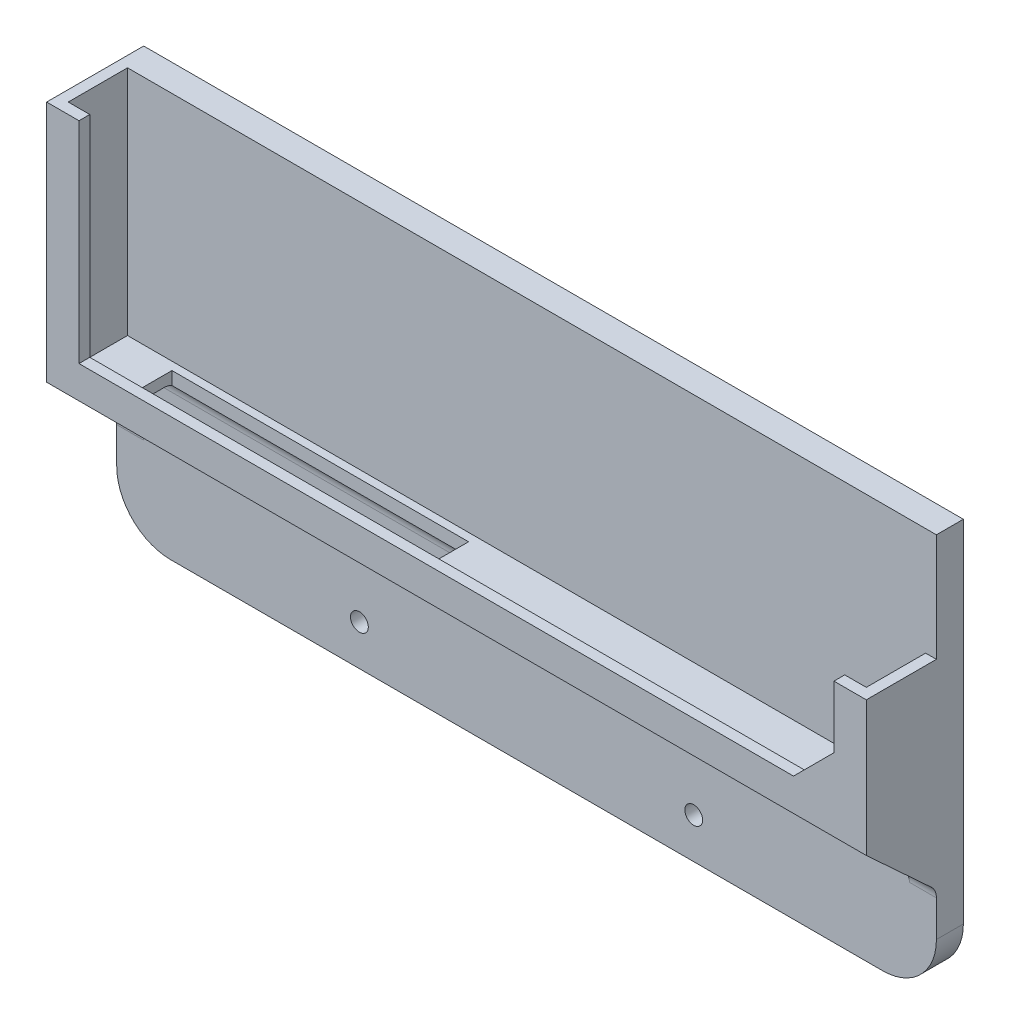
ISO-10303-21;
HEADER;
FILE_DESCRIPTION(('STEP AP214'),'2;1');
FILE_NAME('part.step','',(''),(''),'','','');
FILE_SCHEMA(('AUTOMOTIVE_DESIGN { 1 0 10303 214 1 1 1 1 }'));
ENDSEC;
DATA;
#1=APPLICATION_CONTEXT('core data for automotive mechanical design processes');
#2=APPLICATION_PROTOCOL_DEFINITION('international standard','automotive_design',2000,#1);
#3=PRODUCT_CONTEXT('',#1,'mechanical');
#4=PRODUCT('Part','Part','',(#3));
#5=PRODUCT_RELATED_PRODUCT_CATEGORY('part','',(#4));
#6=PRODUCT_DEFINITION_FORMATION('','',#4);
#7=PRODUCT_DEFINITION_CONTEXT('part definition',#1,'design');
#8=PRODUCT_DEFINITION('design','',#6,#7);
#9=PRODUCT_DEFINITION_SHAPE('','',#8);
#10=(LENGTH_UNIT() NAMED_UNIT(*) SI_UNIT(.MILLI.,.METRE.));
#11=(NAMED_UNIT(*) PLANE_ANGLE_UNIT() SI_UNIT($,.RADIAN.));
#12=(NAMED_UNIT(*) SI_UNIT($,.STERADIAN.) SOLID_ANGLE_UNIT());
#13=UNCERTAINTY_MEASURE_WITH_UNIT(LENGTH_MEASURE(1.E-05),#10,'distance_accuracy_value','');
#14=(GEOMETRIC_REPRESENTATION_CONTEXT(3) GLOBAL_UNCERTAINTY_ASSIGNED_CONTEXT((#13)) GLOBAL_UNIT_ASSIGNED_CONTEXT((#10,
#11,#12)) REPRESENTATION_CONTEXT('',''));
#15=CARTESIAN_POINT('',(0.,0.,0.));
#16=DIRECTION('',(0.,0.,1.));
#17=DIRECTION('',(1.,0.,0.));
#18=AXIS2_PLACEMENT_3D('',#15,#16,#17);
#19=CARTESIAN_POINT('',(0.,30.,16.));
#20=DIRECTION('',(0.,1.,0.));
#21=DIRECTION('',(0.,0.,1.));
#22=AXIS2_PLACEMENT_3D('',#19,#20,#21);
#23=PLANE('',#22);
#24=DIRECTION('',(0.,0.,-1.));
#25=VECTOR('',#24,1.);
#26=CARTESIAN_POINT('',(11.7410881152894,30.,16.));
#27=LINE('',#26,#25);
#28=CARTESIAN_POINT('',(11.7410881152894,30.,14.5));
#29=VERTEX_POINT('',#28);
#30=CARTESIAN_POINT('',(11.7410881152894,30.,8.));
#31=VERTEX_POINT('',#30);
#32=EDGE_CURVE('E269',#29,#31,#27,.T.);
#33=ORIENTED_EDGE('',*,*,#32,.F.);
#34=DIRECTION('',(1.,0.,0.));
#35=VECTOR('',#34,1.);
#36=CARTESIAN_POINT('',(0.,30.,14.5));
#37=LINE('',#36,#35);
#38=CARTESIAN_POINT('',(66.7410881152894,30.,14.5));
#39=VERTEX_POINT('',#38);
#40=EDGE_CURVE('E272',#29,#39,#37,.T.);
#41=ORIENTED_EDGE('',*,*,#40,.T.);
#42=DIRECTION('',(0.,0.,-1.));
#43=VECTOR('',#42,1.);
#44=CARTESIAN_POINT('',(66.7410881152894,30.,16.));
#45=LINE('',#44,#43);
#46=CARTESIAN_POINT('',(66.7410881152894,30.,8.));
#47=VERTEX_POINT('',#46);
#48=EDGE_CURVE('E261',#39,#47,#45,.T.);
#49=ORIENTED_EDGE('',*,*,#48,.T.);
#50=DIRECTION('',(1.,0.,0.));
#51=VECTOR('',#50,1.);
#52=CARTESIAN_POINT('',(0.,30.,8.));
#53=LINE('',#52,#51);
#54=CARTESIAN_POINT('',(147.,30.,8.));
#55=VERTEX_POINT('',#54);
#56=EDGE_CURVE('E512',#47,#55,#53,.T.);
#57=ORIENTED_EDGE('',*,*,#56,.T.);
#58=DIRECTION('',(0.,0.,-1.));
#59=VECTOR('',#58,1.);
#60=CARTESIAN_POINT('',(147.,30.,18.));
#61=LINE('',#60,#59);
#62=CARTESIAN_POINT('',(147.,30.,18.));
#63=VERTEX_POINT('',#62);
#64=EDGE_CURVE('E277',#63,#55,#61,.T.);
#65=ORIENTED_EDGE('',*,*,#64,.F.);
#66=DIRECTION('',(1.,0.,0.));
#67=VECTOR('',#66,1.);
#68=CARTESIAN_POINT('',(0.,30.,18.));
#69=LINE('',#68,#67);
#70=CARTESIAN_POINT('',(5.,30.,18.));
#71=VERTEX_POINT('',#70);
#72=EDGE_CURVE('E320',#71,#63,#69,.T.);
#73=ORIENTED_EDGE('',*,*,#72,.F.);
#74=DIRECTION('',(0.,0.,-1.));
#75=VECTOR('',#74,1.);
#76=CARTESIAN_POINT('',(5.,30.,18.));
#77=LINE('',#76,#75);
#78=CARTESIAN_POINT('',(5.,30.,8.));
#79=VERTEX_POINT('',#78);
#80=EDGE_CURVE('E296',#71,#79,#77,.T.);
#81=ORIENTED_EDGE('',*,*,#80,.T.);
#82=EDGE_CURVE('E513',#79,#31,#53,.T.);
#83=ORIENTED_EDGE('',*,*,#82,.T.);
#84=EDGE_LOOP('',(#33,#41,#49,#57,#65,#73,#81,#83));
#85=FACE_BOUND('',#84,.T.);
#86=ADVANCED_FACE('F40',(#85),#23,.F.);
#87=CARTESIAN_POINT('',(0.,27.,8.));
#88=DIRECTION('',(1.,0.,0.));
#89=DIRECTION('',(0.,0.,-1.));
#90=AXIS2_PLACEMENT_3D('',#87,#88,#89);
#91=CYLINDRICAL_SURFACE('',#90,3.);
#92=CARTESIAN_POINT('',(11.7410881152894,27.,8.));
#93=DIRECTION('',(1.,0.,0.));
#94=DIRECTION('',(0.,0.,-1.));
#95=AXIS2_PLACEMENT_3D('',#92,#93,#94);
#96=CIRCLE('',#95,3.);
#97=CARTESIAN_POINT('',(11.7410881152894,29.5980762113533,6.5));
#98=VERTEX_POINT('',#97);
#99=EDGE_CURVE('E11',#31,#98,#96,.F.);
#100=ORIENTED_EDGE('',*,*,#99,.F.);
#101=ORIENTED_EDGE('',*,*,#82,.F.);
#102=CARTESIAN_POINT('',(5.,27.,8.));
#103=DIRECTION('',(-1.,0.,0.));
#104=DIRECTION('',(0.,0.,1.));
#105=AXIS2_PLACEMENT_3D('',#102,#103,#104);
#106=CIRCLE('',#105,3.);
#107=CARTESIAN_POINT('',(5.,27.,5.));
#108=VERTEX_POINT('',#107);
#109=EDGE_CURVE('E531',#108,#79,#106,.F.);
#110=ORIENTED_EDGE('',*,*,#109,.F.);
#111=DIRECTION('',(1.,0.,0.));
#112=VECTOR('',#111,1.);
#113=CARTESIAN_POINT('',(0.,27.,5.));
#114=LINE('',#113,#112);
#115=CARTESIAN_POINT('',(147.,27.,5.));
#116=VERTEX_POINT('',#115);
#117=EDGE_CURVE('E528',#116,#108,#114,.F.);
#118=ORIENTED_EDGE('',*,*,#117,.F.);
#119=CARTESIAN_POINT('',(147.,27.,8.));
#120=DIRECTION('',(1.,0.,0.));
#121=DIRECTION('',(0.,0.,-1.));
#122=AXIS2_PLACEMENT_3D('',#119,#120,#121);
#123=CIRCLE('',#122,3.);
#124=EDGE_CURVE('E517',#55,#116,#123,.F.);
#125=ORIENTED_EDGE('',*,*,#124,.F.);
#126=ORIENTED_EDGE('',*,*,#56,.F.);
#127=CARTESIAN_POINT('',(66.7410881152894,27.,8.));
#128=DIRECTION('',(1.,0.,0.));
#129=DIRECTION('',(0.,0.,-1.));
#130=AXIS2_PLACEMENT_3D('',#127,#128,#129);
#131=CIRCLE('',#130,3.);
#132=CARTESIAN_POINT('',(66.7410881152894,29.5980762113533,6.5));
#133=VERTEX_POINT('',#132);
#134=EDGE_CURVE('E554',#47,#133,#131,.F.);
#135=ORIENTED_EDGE('',*,*,#134,.T.);
#136=DIRECTION('',(1.,0.,0.));
#137=VECTOR('',#136,1.);
#138=CARTESIAN_POINT('',(0.,29.5980762113533,6.5));
#139=LINE('',#138,#137);
#140=EDGE_CURVE('E49',#98,#133,#139,.T.);
#141=ORIENTED_EDGE('',*,*,#140,.F.);
#142=EDGE_LOOP('',(#100,#101,#110,#118,#125,#126,#135,#141));
#143=FACE_BOUND('',#142,.T.);
#144=ADVANCED_FACE('F652',(#143),#91,.F.);
#145=CARTESIAN_POINT('',(0.,0.,5.));
#146=DIRECTION('',(0.,0.,1.));
#147=DIRECTION('',(1.,0.,0.));
#148=AXIS2_PLACEMENT_3D('',#145,#146,#147);
#149=PLANE('',#148);
#150=DIRECTION('',(0.,-1.,0.));
#151=VECTOR('',#150,1.);
#152=CARTESIAN_POINT('',(147.,30.,5.));
#153=LINE('',#152,#151);
#154=CARTESIAN_POINT('',(147.,16.6865063047027,5.));
#155=VERTEX_POINT('',#154);
#156=EDGE_CURVE('E285',#116,#155,#153,.T.);
#157=ORIENTED_EDGE('',*,*,#156,.F.);
#158=ORIENTED_EDGE('',*,*,#117,.T.);
#159=DIRECTION('',(0.,-1.,0.));
#160=VECTOR('',#159,1.);
#161=CARTESIAN_POINT('',(5.,30.,5.));
#162=LINE('',#161,#160);
#163=CARTESIAN_POINT('',(5.,16.6865063047027,5.));
#164=VERTEX_POINT('',#163);
#165=EDGE_CURVE('E300',#108,#164,#162,.T.);
#166=ORIENTED_EDGE('',*,*,#165,.T.);
#167=DIRECTION('',(-1.,0.,0.));
#168=VECTOR('',#167,1.);
#169=CARTESIAN_POINT('',(0.,16.6865063047027,5.));
#170=LINE('',#169,#168);
#171=CARTESIAN_POINT('',(0.,16.6865063047027,5.));
#172=VERTEX_POINT('',#171);
#173=EDGE_CURVE('E520',#164,#172,#170,.T.);
#174=ORIENTED_EDGE('',*,*,#173,.T.);
#175=DIRECTION('',(0.,1.,0.));
#176=VECTOR('',#175,1.);
#177=CARTESIAN_POINT('',(0.,0.,5.));
#178=LINE('',#177,#176);
#179=CARTESIAN_POINT('',(0.,10.,5.));
#180=VERTEX_POINT('',#179);
#181=EDGE_CURVE('E420',#180,#172,#178,.T.);
#182=ORIENTED_EDGE('',*,*,#181,.F.);
#183=CARTESIAN_POINT('',(10.,10.,5.));
#184=DIRECTION('',(0.,0.,1.));
#185=DIRECTION('',(1.,0.,0.));
#186=AXIS2_PLACEMENT_3D('',#183,#184,#185);
#187=CIRCLE('',#186,10.);
#188=CARTESIAN_POINT('',(10.,0.,5.));
#189=VERTEX_POINT('',#188);
#190=EDGE_CURVE('E490',#180,#189,#187,.T.);
#191=ORIENTED_EDGE('',*,*,#190,.T.);
#192=DIRECTION('',(1.,0.,0.));
#193=VECTOR('',#192,1.);
#194=CARTESIAN_POINT('',(0.,0.,5.));
#195=LINE('',#194,#193);
#196=CARTESIAN_POINT('',(142.,0.,5.));
#197=VERTEX_POINT('',#196);
#198=EDGE_CURVE('E424',#189,#197,#195,.T.);
#199=ORIENTED_EDGE('',*,*,#198,.T.);
#200=CARTESIAN_POINT('',(142.,10.,5.));
#201=DIRECTION('',(0.,0.,1.));
#202=DIRECTION('',(1.,0.,0.));
#203=AXIS2_PLACEMENT_3D('',#200,#201,#202);
#204=CIRCLE('',#203,10.);
#205=CARTESIAN_POINT('',(152.,10.,5.));
#206=VERTEX_POINT('',#205);
#207=EDGE_CURVE('E493',#197,#206,#204,.T.);
#208=ORIENTED_EDGE('',*,*,#207,.T.);
#209=DIRECTION('',(0.,1.,0.));
#210=VECTOR('',#209,1.);
#211=CARTESIAN_POINT('',(152.,0.,5.));
#212=LINE('',#211,#210);
#213=CARTESIAN_POINT('',(152.,16.6865063047027,5.));
#214=VERTEX_POINT('',#213);
#215=EDGE_CURVE('E430',#206,#214,#212,.T.);
#216=ORIENTED_EDGE('',*,*,#215,.T.);
#217=DIRECTION('',(1.,0.,0.));
#218=VECTOR('',#217,1.);
#219=CARTESIAN_POINT('',(147.,16.6865063047027,5.));
#220=LINE('',#219,#218);
#221=EDGE_CURVE('E524',#214,#155,#220,.F.);
#222=ORIENTED_EDGE('',*,*,#221,.T.);
#223=EDGE_LOOP('',(#157,#158,#166,#174,#182,#191,#199,#208,#216,#222));
#224=FACE_BOUND('',#223,.T.);
#225=CARTESIAN_POINT('',(107.,7.5,5.));
#226=DIRECTION('',(0.,0.,1.));
#227=DIRECTION('',(1.,0.,0.));
#228=AXIS2_PLACEMENT_3D('',#225,#226,#227);
#229=CIRCLE('',#228,1.64999999999999);
#230=CARTESIAN_POINT('',(108.65,7.5,5.));
#231=VERTEX_POINT('',#230);
#232=EDGE_CURVE('E437',#231,#231,#229,.T.);
#233=ORIENTED_EDGE('',*,*,#232,.F.);
#234=EDGE_LOOP('',(#233));
#235=FACE_BOUND('',#234,.T.);
#236=CARTESIAN_POINT('',(45.,7.5,5.));
#237=DIRECTION('',(0.,0.,1.));
#238=DIRECTION('',(1.,0.,0.));
#239=AXIS2_PLACEMENT_3D('',#236,#237,#238);
#240=CIRCLE('',#239,1.65);
#241=CARTESIAN_POINT('',(46.65,7.5,5.));
#242=VERTEX_POINT('',#241);
#243=EDGE_CURVE('E441',#242,#242,#240,.T.);
#244=ORIENTED_EDGE('',*,*,#243,.F.);
#245=EDGE_LOOP('',(#244));
#246=FACE_BOUND('',#245,.T.);
#247=ADVANCED_FACE('F588',(#224,#235,#246),#149,.T.);
#248=DIRECTION('',(0.,1.,0.));
#249=VECTOR('',#248,1.);
#250=CARTESIAN_POINT('',(2.,73.,5.));
#251=LINE('',#250,#249);
#252=CARTESIAN_POINT('',(2.00000000000001,32.,5.));
#253=VERTEX_POINT('',#252);
#254=CARTESIAN_POINT('',(2.,75.,5.));
#255=VERTEX_POINT('',#254);
#256=EDGE_CURVE('E377',#253,#255,#251,.T.);
#257=ORIENTED_EDGE('',*,*,#256,.F.);
#258=DIRECTION('',(-1.,0.,0.));
#259=VECTOR('',#258,1.);
#260=CARTESIAN_POINT('',(2.00000000000001,32.,5.));
#261=LINE('',#260,#259);
#262=CARTESIAN_POINT('',(150.,32.,5.));
#263=VERTEX_POINT('',#262);
#264=EDGE_CURVE('E393',#263,#253,#261,.T.);
#265=ORIENTED_EDGE('',*,*,#264,.F.);
#266=DIRECTION('',(0.,-1.,0.));
#267=VECTOR('',#266,1.);
#268=CARTESIAN_POINT('',(150.,55.,5.));
#269=LINE('',#268,#267);
#270=CARTESIAN_POINT('',(150.,55.,5.));
#271=VERTEX_POINT('',#270);
#272=EDGE_CURVE('E389',#271,#263,#269,.T.);
#273=ORIENTED_EDGE('',*,*,#272,.F.);
#274=DIRECTION('',(-1.,0.,0.));
#275=VECTOR('',#274,1.);
#276=CARTESIAN_POINT('',(152.,55.,5.));
#277=LINE('',#276,#275);
#278=CARTESIAN_POINT('',(152.,55.,5.));
#279=VERTEX_POINT('',#278);
#280=EDGE_CURVE('E371',#279,#271,#277,.T.);
#281=ORIENTED_EDGE('',*,*,#280,.F.);
#282=CARTESIAN_POINT('',(152.,75.,5.));
#283=VERTEX_POINT('',#282);
#284=EDGE_CURVE('E429',#279,#283,#212,.T.);
#285=ORIENTED_EDGE('',*,*,#284,.T.);
#286=DIRECTION('',(1.,0.,0.));
#287=VECTOR('',#286,1.);
#288=CARTESIAN_POINT('',(0.,75.,5.));
#289=LINE('',#288,#287);
#290=EDGE_CURVE('E434',#255,#283,#289,.T.);
#291=ORIENTED_EDGE('',*,*,#290,.F.);
#292=EDGE_LOOP('',(#257,#265,#273,#281,#285,#291));
#293=FACE_BOUND('',#292,.T.);
#294=ADVANCED_FACE('F638',(#293),#149,.T.);
#295=CARTESIAN_POINT('',(0.,0.,5.));
#296=DIRECTION('',(-1.,0.,0.));
#297=DIRECTION('',(0.,0.,1.));
#298=AXIS2_PLACEMENT_3D('',#295,#296,#297);
#299=PLANE('',#298);
#300=ORIENTED_EDGE('',*,*,#181,.T.);
#301=CARTESIAN_POINT('',(0.,16.6865063047027,8.));
#302=DIRECTION('',(-1.,0.,0.));
#303=DIRECTION('',(0.,0.,1.));
#304=AXIS2_PLACEMENT_3D('',#301,#302,#303);
#305=CIRCLE('',#304,3.);
#306=CARTESIAN_POINT('',(0.,18.8909166385851,5.96515969180078));
#307=VERTEX_POINT('',#306);
#308=EDGE_CURVE('E547',#172,#307,#305,.F.);
#309=ORIENTED_EDGE('',*,*,#308,.T.);
#310=DIRECTION('',(0.,-0.678280102733072,-0.734803444627482));
#311=VECTOR('',#310,1.);
#312=CARTESIAN_POINT('',(0.,30.,18.));
#313=LINE('',#312,#311);
#314=CARTESIAN_POINT('',(0.,30.,18.));
#315=VERTEX_POINT('',#314);
#316=EDGE_CURVE('E295',#315,#307,#313,.T.);
#317=ORIENTED_EDGE('',*,*,#316,.F.);
#318=DIRECTION('',(0.,-1.,0.));
#319=VECTOR('',#318,1.);
#320=CARTESIAN_POINT('',(0.,75.,18.));
#321=LINE('',#320,#319);
#322=CARTESIAN_POINT('',(0.,75.,18.));
#323=VERTEX_POINT('',#322);
#324=EDGE_CURVE('E315',#323,#315,#321,.T.);
#325=ORIENTED_EDGE('',*,*,#324,.F.);
#326=DIRECTION('',(0.,0.,-1.));
#327=VECTOR('',#326,1.);
#328=CARTESIAN_POINT('',(0.,75.,5.));
#329=LINE('',#328,#327);
#330=CARTESIAN_POINT('',(0.,75.,0.));
#331=VERTEX_POINT('',#330);
#332=EDGE_CURVE('E445',#323,#331,#329,.T.);
#333=ORIENTED_EDGE('',*,*,#332,.T.);
#334=DIRECTION('',(0.,1.,0.));
#335=VECTOR('',#334,1.);
#336=CARTESIAN_POINT('',(0.,0.,0.));
#337=LINE('',#336,#335);
#338=CARTESIAN_POINT('',(0.,10.,0.));
#339=VERTEX_POINT('',#338);
#340=EDGE_CURVE('E419',#339,#331,#337,.T.);
#341=ORIENTED_EDGE('',*,*,#340,.F.);
#342=DIRECTION('',(0.,0.,-1.));
#343=VECTOR('',#342,1.);
#344=CARTESIAN_POINT('',(0.,10.,5.));
#345=LINE('',#344,#343);
#346=EDGE_CURVE('E496',#339,#180,#345,.F.);
#347=ORIENTED_EDGE('',*,*,#346,.T.);
#348=EDGE_LOOP('',(#300,#309,#317,#325,#333,#341,#347));
#349=FACE_BOUND('',#348,.T.);
#350=ADVANCED_FACE('F682',(#349),#299,.T.);
#351=CARTESIAN_POINT('',(0.,0.,5.));
#352=DIRECTION('',(0.,1.,0.));
#353=DIRECTION('',(0.,0.,1.));
#354=AXIS2_PLACEMENT_3D('',#351,#352,#353);
#355=PLANE('',#354);
#356=DIRECTION('',(1.,0.,0.));
#357=VECTOR('',#356,1.);
#358=CARTESIAN_POINT('',(0.,0.,0.));
#359=LINE('',#358,#357);
#360=CARTESIAN_POINT('',(10.,0.,0.));
#361=VERTEX_POINT('',#360);
#362=CARTESIAN_POINT('',(142.,0.,0.));
#363=VERTEX_POINT('',#362);
#364=EDGE_CURVE('E448',#361,#363,#359,.T.);
#365=ORIENTED_EDGE('',*,*,#364,.T.);
#366=DIRECTION('',(0.,0.,-1.));
#367=VECTOR('',#366,1.);
#368=CARTESIAN_POINT('',(142.,0.,5.));
#369=LINE('',#368,#367);
#370=EDGE_CURVE('E487',#363,#197,#369,.F.);
#371=ORIENTED_EDGE('',*,*,#370,.T.);
#372=ORIENTED_EDGE('',*,*,#198,.F.);
#373=DIRECTION('',(0.,0.,-1.));
#374=VECTOR('',#373,1.);
#375=CARTESIAN_POINT('',(10.,0.,0.));
#376=LINE('',#375,#374);
#377=EDGE_CURVE('E483',#189,#361,#376,.T.);
#378=ORIENTED_EDGE('',*,*,#377,.T.);
#379=EDGE_LOOP('',(#365,#371,#372,#378));
#380=FACE_BOUND('',#379,.T.);
#381=ADVANCED_FACE('F679',(#380),#355,.F.);
#382=CARTESIAN_POINT('',(152.,0.,5.));
#383=DIRECTION('',(-1.,0.,0.));
#384=DIRECTION('',(0.,0.,1.));
#385=AXIS2_PLACEMENT_3D('',#382,#383,#384);
#386=PLANE('',#385);
#387=ORIENTED_EDGE('',*,*,#215,.F.);
#388=DIRECTION('',(0.,0.,-1.));
#389=VECTOR('',#388,1.);
#390=CARTESIAN_POINT('',(152.,10.,5.));
#391=LINE('',#390,#389);
#392=CARTESIAN_POINT('',(152.,10.,0.));
#393=VERTEX_POINT('',#392);
#394=EDGE_CURVE('E473',#206,#393,#391,.T.);
#395=ORIENTED_EDGE('',*,*,#394,.T.);
#396=DIRECTION('',(0.,1.,0.));
#397=VECTOR('',#396,1.);
#398=CARTESIAN_POINT('',(152.,0.,0.));
#399=LINE('',#398,#397);
#400=CARTESIAN_POINT('',(152.,75.,0.));
#401=VERTEX_POINT('',#400);
#402=EDGE_CURVE('E452',#393,#401,#399,.T.);
#403=ORIENTED_EDGE('',*,*,#402,.T.);
#404=DIRECTION('',(0.,0.,-1.));
#405=VECTOR('',#404,1.);
#406=CARTESIAN_POINT('',(152.,75.,5.));
#407=LINE('',#406,#405);
#408=EDGE_CURVE('E469',#283,#401,#407,.T.);
#409=ORIENTED_EDGE('',*,*,#408,.F.);
#410=ORIENTED_EDGE('',*,*,#284,.F.);
#411=DIRECTION('',(0.,0.,-1.));
#412=VECTOR('',#411,1.);
#413=CARTESIAN_POINT('',(152.,55.,16.));
#414=LINE('',#413,#412);
#415=CARTESIAN_POINT('',(152.,55.,18.));
#416=VERTEX_POINT('',#415);
#417=EDGE_CURVE('E415',#416,#279,#414,.T.);
#418=ORIENTED_EDGE('',*,*,#417,.F.);
#419=DIRECTION('',(0.,1.,0.));
#420=VECTOR('',#419,1.);
#421=CARTESIAN_POINT('',(152.,30.,18.));
#422=LINE('',#421,#420);
#423=CARTESIAN_POINT('',(152.,30.,18.));
#424=VERTEX_POINT('',#423);
#425=EDGE_CURVE('E325',#424,#416,#422,.T.);
#426=ORIENTED_EDGE('',*,*,#425,.F.);
#427=DIRECTION('',(0.,-0.678280102733072,-0.734803444627482));
#428=VECTOR('',#427,1.);
#429=CARTESIAN_POINT('',(152.,30.,18.));
#430=LINE('',#429,#428);
#431=CARTESIAN_POINT('',(152.,18.8909166385851,5.96515969180078));
#432=VERTEX_POINT('',#431);
#433=EDGE_CURVE('E276',#424,#432,#430,.T.);
#434=ORIENTED_EDGE('',*,*,#433,.T.);
#435=CARTESIAN_POINT('',(152.,16.6865063047027,8.));
#436=DIRECTION('',(-1.,0.,0.));
#437=DIRECTION('',(0.,0.,1.));
#438=AXIS2_PLACEMENT_3D('',#435,#436,#437);
#439=CIRCLE('',#438,3.);
#440=EDGE_CURVE('E541',#432,#214,#439,.T.);
#441=ORIENTED_EDGE('',*,*,#440,.T.);
#442=EDGE_LOOP('',(#387,#395,#403,#409,#410,#418,#426,#434,#441));
#443=FACE_BOUND('',#442,.T.);
#444=ADVANCED_FACE('F585',(#443),#386,.F.);
#445=CARTESIAN_POINT('',(107.,7.5,5.));
#446=DIRECTION('',(0.,0.,-1.));
#447=DIRECTION('',(-1.,0.,0.));
#448=AXIS2_PLACEMENT_3D('',#445,#446,#447);
#449=CYLINDRICAL_SURFACE('',#448,1.64999999999999);
#450=ORIENTED_EDGE('',*,*,#232,.T.);
#451=EDGE_LOOP('',(#450));
#452=FACE_BOUND('',#451,.T.);
#453=CARTESIAN_POINT('',(107.,7.5,0.));
#454=DIRECTION('',(0.,0.,1.));
#455=DIRECTION('',(1.,0.,0.));
#456=AXIS2_PLACEMENT_3D('',#453,#454,#455);
#457=CIRCLE('',#456,1.64999999999999);
#458=CARTESIAN_POINT('',(108.65,7.5,0.));
#459=VERTEX_POINT('',#458);
#460=EDGE_CURVE('E459',#459,#459,#457,.T.);
#461=ORIENTED_EDGE('',*,*,#460,.F.);
#462=EDGE_LOOP('',(#461));
#463=FACE_BOUND('',#462,.T.);
#464=ADVANCED_FACE('F671',(#452,#463),#449,.F.);
#465=CARTESIAN_POINT('',(0.,75.,5.));
#466=DIRECTION('',(0.,1.,0.));
#467=DIRECTION('',(0.,0.,1.));
#468=AXIS2_PLACEMENT_3D('',#465,#466,#467);
#469=PLANE('',#468);
#470=DIRECTION('',(1.,0.,0.));
#471=VECTOR('',#470,1.);
#472=CARTESIAN_POINT('',(0.,75.,0.));
#473=LINE('',#472,#471);
#474=EDGE_CURVE('E455',#331,#401,#473,.T.);
#475=ORIENTED_EDGE('',*,*,#474,.F.);
#476=ORIENTED_EDGE('',*,*,#332,.F.);
#477=DIRECTION('',(-1.,0.,0.));
#478=VECTOR('',#477,1.);
#479=CARTESIAN_POINT('',(6.,75.,18.));
#480=LINE('',#479,#478);
#481=CARTESIAN_POINT('',(6.,75.,18.));
#482=VERTEX_POINT('',#481);
#483=EDGE_CURVE('E311',#482,#323,#480,.T.);
#484=ORIENTED_EDGE('',*,*,#483,.F.);
#485=DIRECTION('',(0.,0.,-1.));
#486=VECTOR('',#485,1.);
#487=CARTESIAN_POINT('',(6.,75.,18.));
#488=LINE('',#487,#486);
#489=CARTESIAN_POINT('',(6.,75.,16.));
#490=VERTEX_POINT('',#489);
#491=EDGE_CURVE('E344',#482,#490,#488,.T.);
#492=ORIENTED_EDGE('',*,*,#491,.T.);
#493=DIRECTION('',(-1.,0.,0.));
#494=VECTOR('',#493,1.);
#495=CARTESIAN_POINT('',(6.,75.,16.));
#496=LINE('',#495,#494);
#497=CARTESIAN_POINT('',(2.00000000000001,75.,16.));
#498=VERTEX_POINT('',#497);
#499=EDGE_CURVE('E307',#490,#498,#496,.T.);
#500=ORIENTED_EDGE('',*,*,#499,.T.);
#501=DIRECTION('',(0.,0.,-1.));
#502=VECTOR('',#501,1.);
#503=CARTESIAN_POINT('',(2.,75.,16.));
#504=LINE('',#503,#502);
#505=EDGE_CURVE('E385',#498,#255,#504,.T.);
#506=ORIENTED_EDGE('',*,*,#505,.T.);
#507=ORIENTED_EDGE('',*,*,#290,.T.);
#508=ORIENTED_EDGE('',*,*,#408,.T.);
#509=EDGE_LOOP('',(#475,#476,#484,#492,#500,#506,#507,#508));
#510=FACE_BOUND('',#509,.T.);
#511=ADVANCED_FACE('F604',(#510),#469,.T.);
#512=CARTESIAN_POINT('',(45.,7.5,5.));
#513=DIRECTION('',(0.,0.,-1.));
#514=DIRECTION('',(-1.,0.,0.));
#515=AXIS2_PLACEMENT_3D('',#512,#513,#514);
#516=CYLINDRICAL_SURFACE('',#515,1.65);
#517=ORIENTED_EDGE('',*,*,#243,.T.);
#518=EDGE_LOOP('',(#517));
#519=FACE_BOUND('',#518,.T.);
#520=CARTESIAN_POINT('',(45.,7.5,0.));
#521=DIRECTION('',(0.,0.,1.));
#522=DIRECTION('',(1.,0.,0.));
#523=AXIS2_PLACEMENT_3D('',#520,#521,#522);
#524=CIRCLE('',#523,1.65);
#525=CARTESIAN_POINT('',(46.65,7.5,0.));
#526=VERTEX_POINT('',#525);
#527=EDGE_CURVE('E425',#526,#526,#524,.T.);
#528=ORIENTED_EDGE('',*,*,#527,.F.);
#529=EDGE_LOOP('',(#528));
#530=FACE_BOUND('',#529,.T.);
#531=ADVANCED_FACE('F667',(#519,#530),#516,.F.);
#532=CARTESIAN_POINT('',(0.,0.,0.));
#533=DIRECTION('',(0.,0.,1.));
#534=DIRECTION('',(1.,0.,0.));
#535=AXIS2_PLACEMENT_3D('',#532,#533,#534);
#536=PLANE('',#535);
#537=ORIENTED_EDGE('',*,*,#402,.F.);
#538=CARTESIAN_POINT('',(142.,10.,0.));
#539=DIRECTION('',(0.,0.,1.));
#540=DIRECTION('',(1.,0.,0.));
#541=AXIS2_PLACEMENT_3D('',#538,#539,#540);
#542=CIRCLE('',#541,10.);
#543=EDGE_CURVE('E480',#393,#363,#542,.F.);
#544=ORIENTED_EDGE('',*,*,#543,.T.);
#545=ORIENTED_EDGE('',*,*,#364,.F.);
#546=CARTESIAN_POINT('',(10.,10.,0.));
#547=DIRECTION('',(0.,0.,1.));
#548=DIRECTION('',(1.,0.,0.));
#549=AXIS2_PLACEMENT_3D('',#546,#547,#548);
#550=CIRCLE('',#549,10.);
#551=EDGE_CURVE('E477',#361,#339,#550,.F.);
#552=ORIENTED_EDGE('',*,*,#551,.T.);
#553=ORIENTED_EDGE('',*,*,#340,.T.);
#554=ORIENTED_EDGE('',*,*,#474,.T.);
#555=EDGE_LOOP('',(#537,#544,#545,#552,#553,#554));
#556=FACE_BOUND('',#555,.T.);
#557=ORIENTED_EDGE('',*,*,#460,.T.);
#558=EDGE_LOOP('',(#557));
#559=FACE_BOUND('',#558,.T.);
#560=ORIENTED_EDGE('',*,*,#527,.T.);
#561=EDGE_LOOP('',(#560));
#562=FACE_BOUND('',#561,.T.);
#563=ADVANCED_FACE('F598',(#556,#559,#562),#536,.F.);
#564=CARTESIAN_POINT('',(142.,10.,5.));
#565=DIRECTION('',(0.,0.,-1.));
#566=DIRECTION('',(-1.,0.,0.));
#567=AXIS2_PLACEMENT_3D('',#564,#565,#566);
#568=CYLINDRICAL_SURFACE('',#567,10.);
#569=ORIENTED_EDGE('',*,*,#207,.F.);
#570=ORIENTED_EDGE('',*,*,#370,.F.);
#571=ORIENTED_EDGE('',*,*,#543,.F.);
#572=ORIENTED_EDGE('',*,*,#394,.F.);
#573=EDGE_LOOP('',(#569,#570,#571,#572));
#574=FACE_BOUND('',#573,.T.);
#575=ADVANCED_FACE('F594',(#574),#568,.T.);
#576=CARTESIAN_POINT('',(10.,10.,5.));
#577=DIRECTION('',(0.,0.,1.));
#578=DIRECTION('',(1.,0.,0.));
#579=AXIS2_PLACEMENT_3D('',#576,#577,#578);
#580=CYLINDRICAL_SURFACE('',#579,10.);
#581=ORIENTED_EDGE('',*,*,#190,.F.);
#582=ORIENTED_EDGE('',*,*,#346,.F.);
#583=ORIENTED_EDGE('',*,*,#551,.F.);
#584=ORIENTED_EDGE('',*,*,#377,.F.);
#585=EDGE_LOOP('',(#581,#582,#583,#584));
#586=FACE_BOUND('',#585,.T.);
#587=ADVANCED_FACE('F689',(#586),#580,.T.);
#588=CARTESIAN_POINT('',(152.,55.,16.));
#589=DIRECTION('',(0.,-1.,0.));
#590=DIRECTION('',(0.,0.,-1.));
#591=AXIS2_PLACEMENT_3D('',#588,#589,#590);
#592=PLANE('',#591);
#593=ORIENTED_EDGE('',*,*,#280,.T.);
#594=DIRECTION('',(0.,0.,-1.));
#595=VECTOR('',#594,1.);
#596=CARTESIAN_POINT('',(150.,55.,16.));
#597=LINE('',#596,#595);
#598=CARTESIAN_POINT('',(150.,55.,16.));
#599=VERTEX_POINT('',#598);
#600=EDGE_CURVE('E411',#599,#271,#597,.T.);
#601=ORIENTED_EDGE('',*,*,#600,.F.);
#602=DIRECTION('',(1.,0.,0.));
#603=VECTOR('',#602,1.);
#604=CARTESIAN_POINT('',(146.,55.,16.));
#605=LINE('',#604,#603);
#606=CARTESIAN_POINT('',(146.,55.,16.));
#607=VERTEX_POINT('',#606);
#608=EDGE_CURVE('E348',#607,#599,#605,.T.);
#609=ORIENTED_EDGE('',*,*,#608,.F.);
#610=DIRECTION('',(0.,0.,-1.));
#611=VECTOR('',#610,1.);
#612=CARTESIAN_POINT('',(146.,55.,18.));
#613=LINE('',#612,#611);
#614=CARTESIAN_POINT('',(146.,55.,18.));
#615=VERTEX_POINT('',#614);
#616=EDGE_CURVE('E367',#615,#607,#613,.T.);
#617=ORIENTED_EDGE('',*,*,#616,.F.);
#618=DIRECTION('',(1.,0.,0.));
#619=VECTOR('',#618,1.);
#620=CARTESIAN_POINT('',(146.,55.,18.));
#621=LINE('',#620,#619);
#622=EDGE_CURVE('E329',#615,#416,#621,.T.);
#623=ORIENTED_EDGE('',*,*,#622,.T.);
#624=ORIENTED_EDGE('',*,*,#417,.T.);
#625=EDGE_LOOP('',(#593,#601,#609,#617,#623,#624));
#626=FACE_BOUND('',#625,.T.);
#627=ADVANCED_FACE('F610',(#626),#592,.F.);
#628=CARTESIAN_POINT('',(150.,55.,16.));
#629=DIRECTION('',(1.,0.,0.));
#630=DIRECTION('',(0.,0.,-1.));
#631=AXIS2_PLACEMENT_3D('',#628,#629,#630);
#632=PLANE('',#631);
#633=ORIENTED_EDGE('',*,*,#272,.T.);
#634=DIRECTION('',(0.,0.,-1.));
#635=VECTOR('',#634,1.);
#636=CARTESIAN_POINT('',(150.,32.,16.));
#637=LINE('',#636,#635);
#638=CARTESIAN_POINT('',(150.,32.,16.));
#639=VERTEX_POINT('',#638);
#640=EDGE_CURVE('E407',#639,#263,#637,.T.);
#641=ORIENTED_EDGE('',*,*,#640,.F.);
#642=DIRECTION('',(0.,-1.,0.));
#643=VECTOR('',#642,1.);
#644=CARTESIAN_POINT('',(150.,55.,16.));
#645=LINE('',#644,#643);
#646=EDGE_CURVE('E372',#599,#639,#645,.T.);
#647=ORIENTED_EDGE('',*,*,#646,.F.);
#648=ORIENTED_EDGE('',*,*,#600,.T.);
#649=EDGE_LOOP('',(#633,#641,#647,#648));
#650=FACE_BOUND('',#649,.T.);
#651=ADVANCED_FACE('F640',(#650),#632,.F.);
#652=CARTESIAN_POINT('',(2.00000000000001,32.,16.));
#653=DIRECTION('',(0.,-1.,0.));
#654=DIRECTION('',(0.,0.,-1.));
#655=AXIS2_PLACEMENT_3D('',#652,#653,#654);
#656=PLANE('',#655);
#657=DIRECTION('',(0.,0.,-1.));
#658=VECTOR('',#657,1.);
#659=CARTESIAN_POINT('',(66.7410881152894,32.,0.));
#660=LINE('',#659,#658);
#661=CARTESIAN_POINT('',(66.7410881152894,32.,14.5));
#662=VERTEX_POINT('',#661);
#663=CARTESIAN_POINT('',(66.7410881152894,32.,6.5));
#664=VERTEX_POINT('',#663);
#665=EDGE_CURVE('E243',#662,#664,#660,.T.);
#666=ORIENTED_EDGE('',*,*,#665,.F.);
#667=DIRECTION('',(1.,0.,0.));
#668=VECTOR('',#667,1.);
#669=CARTESIAN_POINT('',(0.,32.,14.5));
#670=LINE('',#669,#668);
#671=CARTESIAN_POINT('',(11.7410881152894,32.,14.5));
#672=VERTEX_POINT('',#671);
#673=EDGE_CURVE('E56',#672,#662,#670,.T.);
#674=ORIENTED_EDGE('',*,*,#673,.F.);
#675=DIRECTION('',(0.,0.,-1.));
#676=VECTOR('',#675,1.);
#677=CARTESIAN_POINT('',(11.7410881152894,32.,0.));
#678=LINE('',#677,#676);
#679=CARTESIAN_POINT('',(11.7410881152894,32.,6.5));
#680=VERTEX_POINT('',#679);
#681=EDGE_CURVE('E251',#672,#680,#678,.T.);
#682=ORIENTED_EDGE('',*,*,#681,.T.);
#683=DIRECTION('',(1.,0.,0.));
#684=VECTOR('',#683,1.);
#685=CARTESIAN_POINT('',(0.,32.,6.5));
#686=LINE('',#685,#684);
#687=EDGE_CURVE('E234',#680,#664,#686,.T.);
#688=ORIENTED_EDGE('',*,*,#687,.T.);
#689=EDGE_LOOP('',(#666,#674,#682,#688));
#690=FACE_BOUND('',#689,.T.);
#691=ORIENTED_EDGE('',*,*,#264,.T.);
#692=DIRECTION('',(0.,0.,-1.));
#693=VECTOR('',#692,1.);
#694=CARTESIAN_POINT('',(2.00000000000001,32.,16.));
#695=LINE('',#694,#693);
#696=CARTESIAN_POINT('',(2.00000000000001,32.,16.));
#697=VERTEX_POINT('',#696);
#698=EDGE_CURVE('E403',#697,#253,#695,.T.);
#699=ORIENTED_EDGE('',*,*,#698,.F.);
#700=DIRECTION('',(-1.,0.,0.));
#701=VECTOR('',#700,1.);
#702=CARTESIAN_POINT('',(2.00000000000001,32.,16.));
#703=LINE('',#702,#701);
#704=EDGE_CURVE('E376',#639,#697,#703,.T.);
#705=ORIENTED_EDGE('',*,*,#704,.F.);
#706=ORIENTED_EDGE('',*,*,#640,.T.);
#707=EDGE_LOOP('',(#691,#699,#705,#706));
#708=FACE_BOUND('',#707,.T.);
#709=ADVANCED_FACE('F248',(#690,#708),#656,.F.);
#710=CARTESIAN_POINT('',(2.,73.,16.));
#711=DIRECTION('',(-1.,0.,0.));
#712=DIRECTION('',(0.,-1.,0.));
#713=AXIS2_PLACEMENT_3D('',#710,#711,#712);
#714=PLANE('',#713);
#715=ORIENTED_EDGE('',*,*,#256,.T.);
#716=ORIENTED_EDGE('',*,*,#505,.F.);
#717=DIRECTION('',(0.,1.,0.));
#718=VECTOR('',#717,1.);
#719=CARTESIAN_POINT('',(2.,73.,16.));
#720=LINE('',#719,#718);
#721=EDGE_CURVE('E381',#697,#498,#720,.T.);
#722=ORIENTED_EDGE('',*,*,#721,.F.);
#723=ORIENTED_EDGE('',*,*,#698,.T.);
#724=EDGE_LOOP('',(#715,#716,#722,#723));
#725=FACE_BOUND('',#724,.T.);
#726=ADVANCED_FACE('F635',(#725),#714,.F.);
#727=CARTESIAN_POINT('',(0.,0.,16.));
#728=DIRECTION('',(0.,0.,1.));
#729=DIRECTION('',(1.,0.,0.));
#730=AXIS2_PLACEMENT_3D('',#727,#728,#729);
#731=PLANE('',#730);
#732=ORIENTED_EDGE('',*,*,#608,.T.);
#733=ORIENTED_EDGE('',*,*,#646,.T.);
#734=ORIENTED_EDGE('',*,*,#704,.T.);
#735=ORIENTED_EDGE('',*,*,#721,.T.);
#736=ORIENTED_EDGE('',*,*,#499,.F.);
#737=DIRECTION('',(0.,-1.,0.));
#738=VECTOR('',#737,1.);
#739=CARTESIAN_POINT('',(6.,75.,16.));
#740=LINE('',#739,#738);
#741=CARTESIAN_POINT('',(6.00000000000001,36.,16.));
#742=VERTEX_POINT('',#741);
#743=EDGE_CURVE('E316',#490,#742,#740,.T.);
#744=ORIENTED_EDGE('',*,*,#743,.T.);
#745=DIRECTION('',(1.,0.,0.));
#746=VECTOR('',#745,1.);
#747=CARTESIAN_POINT('',(6.00000000000001,36.,16.));
#748=LINE('',#747,#746);
#749=CARTESIAN_POINT('',(138.5,36.,16.));
#750=VERTEX_POINT('',#749);
#751=EDGE_CURVE('E355',#742,#750,#748,.T.);
#752=ORIENTED_EDGE('',*,*,#751,.T.);
#753=DIRECTION('',(-0.707106781186551,-0.707106781186544,0.));
#754=VECTOR('',#753,1.);
#755=CARTESIAN_POINT('',(51.2499999999992,-51.2499999999998,16.));
#756=LINE('',#755,#754);
#757=CARTESIAN_POINT('',(146.,43.5,16.));
#758=VERTEX_POINT('',#757);
#759=EDGE_CURVE('E506',#750,#758,#756,.F.);
#760=ORIENTED_EDGE('',*,*,#759,.T.);
#761=DIRECTION('',(0.,1.,0.));
#762=VECTOR('',#761,1.);
#763=CARTESIAN_POINT('',(146.,36.,16.));
#764=LINE('',#763,#762);
#765=EDGE_CURVE('E352',#758,#607,#764,.T.);
#766=ORIENTED_EDGE('',*,*,#765,.T.);
#767=EDGE_LOOP('',(#732,#733,#734,#735,#736,#744,#752,#760,#766));
#768=FACE_BOUND('',#767,.T.);
#769=ADVANCED_FACE('F626',(#768),#731,.F.);
#770=CARTESIAN_POINT('',(146.,36.,18.));
#771=DIRECTION('',(-1.,0.,0.));
#772=DIRECTION('',(0.,0.,1.));
#773=AXIS2_PLACEMENT_3D('',#770,#771,#772);
#774=PLANE('',#773);
#775=ORIENTED_EDGE('',*,*,#765,.F.);
#776=DIRECTION('',(0.,0.,1.));
#777=VECTOR('',#776,1.);
#778=CARTESIAN_POINT('',(146.,43.5,18.));
#779=LINE('',#778,#777);
#780=CARTESIAN_POINT('',(146.,43.5,18.));
#781=VERTEX_POINT('',#780);
#782=EDGE_CURVE('E503',#758,#781,#779,.T.);
#783=ORIENTED_EDGE('',*,*,#782,.T.);
#784=DIRECTION('',(0.,1.,0.));
#785=VECTOR('',#784,1.);
#786=CARTESIAN_POINT('',(146.,36.,18.));
#787=LINE('',#786,#785);
#788=EDGE_CURVE('E333',#781,#615,#787,.T.);
#789=ORIENTED_EDGE('',*,*,#788,.T.);
#790=ORIENTED_EDGE('',*,*,#616,.T.);
#791=EDGE_LOOP('',(#775,#783,#789,#790));
#792=FACE_BOUND('',#791,.T.);
#793=ADVANCED_FACE('F641',(#792),#774,.T.);
#794=CARTESIAN_POINT('',(6.00000000000001,36.,18.));
#795=DIRECTION('',(0.,1.,0.));
#796=DIRECTION('',(-1.,0.,0.));
#797=AXIS2_PLACEMENT_3D('',#794,#795,#796);
#798=PLANE('',#797);
#799=DIRECTION('',(1.,0.,0.));
#800=VECTOR('',#799,1.);
#801=CARTESIAN_POINT('',(6.00000000000001,36.,18.));
#802=LINE('',#801,#800);
#803=CARTESIAN_POINT('',(6.00000000000001,36.,18.));
#804=VERTEX_POINT('',#803);
#805=CARTESIAN_POINT('',(138.5,36.,18.));
#806=VERTEX_POINT('',#805);
#807=EDGE_CURVE('E336',#804,#806,#802,.T.);
#808=ORIENTED_EDGE('',*,*,#807,.T.);
#809=DIRECTION('',(0.,0.,-1.));
#810=VECTOR('',#809,1.);
#811=CARTESIAN_POINT('',(138.5,36.,16.));
#812=LINE('',#811,#810);
#813=EDGE_CURVE('E499',#806,#750,#812,.T.);
#814=ORIENTED_EDGE('',*,*,#813,.T.);
#815=ORIENTED_EDGE('',*,*,#751,.F.);
#816=DIRECTION('',(0.,0.,-1.));
#817=VECTOR('',#816,1.);
#818=CARTESIAN_POINT('',(6.00000000000001,36.,18.));
#819=LINE('',#818,#817);
#820=EDGE_CURVE('E364',#804,#742,#819,.T.);
#821=ORIENTED_EDGE('',*,*,#820,.F.);
#822=EDGE_LOOP('',(#808,#814,#815,#821));
#823=FACE_BOUND('',#822,.T.);
#824=ADVANCED_FACE('F624',(#823),#798,.T.);
#825=CARTESIAN_POINT('',(6.,75.,18.));
#826=DIRECTION('',(1.,0.,0.));
#827=DIRECTION('',(0.,1.,0.));
#828=AXIS2_PLACEMENT_3D('',#825,#826,#827);
#829=PLANE('',#828);
#830=ORIENTED_EDGE('',*,*,#743,.F.);
#831=ORIENTED_EDGE('',*,*,#491,.F.);
#832=DIRECTION('',(0.,-1.,0.));
#833=VECTOR('',#832,1.);
#834=CARTESIAN_POINT('',(6.,75.,18.));
#835=LINE('',#834,#833);
#836=EDGE_CURVE('E340',#482,#804,#835,.T.);
#837=ORIENTED_EDGE('',*,*,#836,.T.);
#838=ORIENTED_EDGE('',*,*,#820,.T.);
#839=EDGE_LOOP('',(#830,#831,#837,#838));
#840=FACE_BOUND('',#839,.T.);
#841=ADVANCED_FACE('F631',(#840),#829,.T.);
#842=CARTESIAN_POINT('',(0.,0.,18.));
#843=DIRECTION('',(0.,0.,1.));
#844=DIRECTION('',(1.,0.,0.));
#845=AXIS2_PLACEMENT_3D('',#842,#843,#844);
#846=PLANE('',#845);
#847=ORIENTED_EDGE('',*,*,#483,.T.);
#848=ORIENTED_EDGE('',*,*,#324,.T.);
#849=EDGE_CURVE('E321',#315,#71,#69,.T.);
#850=ORIENTED_EDGE('',*,*,#849,.T.);
#851=ORIENTED_EDGE('',*,*,#72,.T.);
#852=DIRECTION('',(1.,0.,0.));
#853=VECTOR('',#852,1.);
#854=CARTESIAN_POINT('',(147.,30.,18.));
#855=LINE('',#854,#853);
#856=EDGE_CURVE('E288',#63,#424,#855,.T.);
#857=ORIENTED_EDGE('',*,*,#856,.T.);
#858=ORIENTED_EDGE('',*,*,#425,.T.);
#859=ORIENTED_EDGE('',*,*,#622,.F.);
#860=ORIENTED_EDGE('',*,*,#788,.F.);
#861=DIRECTION('',(0.707106781186551,0.707106781186544,0.));
#862=VECTOR('',#861,1.);
#863=CARTESIAN_POINT('',(138.5,36.,18.));
#864=LINE('',#863,#862);
#865=EDGE_CURVE('E509',#781,#806,#864,.F.);
#866=ORIENTED_EDGE('',*,*,#865,.T.);
#867=ORIENTED_EDGE('',*,*,#807,.F.);
#868=ORIENTED_EDGE('',*,*,#836,.F.);
#869=EDGE_LOOP('',(#847,#848,#850,#851,#857,#858,#859,#860,#866,#867,#868));
#870=FACE_BOUND('',#869,.T.);
#871=ADVANCED_FACE('F564',(#870),#846,.T.);
#872=CARTESIAN_POINT('',(138.5,36.,18.));
#873=DIRECTION('',(-0.707106781186544,0.707106781186551,0.));
#874=DIRECTION('',(0.,0.,1.));
#875=AXIS2_PLACEMENT_3D('',#872,#873,#874);
#876=PLANE('',#875);
#877=ORIENTED_EDGE('',*,*,#865,.F.);
#878=ORIENTED_EDGE('',*,*,#782,.F.);
#879=ORIENTED_EDGE('',*,*,#759,.F.);
#880=ORIENTED_EDGE('',*,*,#813,.F.);
#881=EDGE_LOOP('',(#877,#878,#879,#880));
#882=FACE_BOUND('',#881,.T.);
#883=ADVANCED_FACE('F621',(#882),#876,.T.);
#884=CARTESIAN_POINT('',(5.,30.,18.));
#885=DIRECTION('',(0.,0.734803444627482,-0.678280102733072));
#886=DIRECTION('',(0.,0.678280102733072,0.734803444627482));
#887=AXIS2_PLACEMENT_3D('',#884,#885,#886);
#888=PLANE('',#887);
#889=ORIENTED_EDGE('',*,*,#316,.T.);
#890=DIRECTION('',(-1.,0.,0.));
#891=VECTOR('',#890,1.);
#892=CARTESIAN_POINT('',(5.,18.8909166385851,5.96515969180078));
#893=LINE('',#892,#891);
#894=CARTESIAN_POINT('',(5.,18.8909166385851,5.96515969180078));
#895=VERTEX_POINT('',#894);
#896=EDGE_CURVE('E538',#307,#895,#893,.F.);
#897=ORIENTED_EDGE('',*,*,#896,.T.);
#898=DIRECTION('',(0.,-0.678280102733072,-0.734803444627482));
#899=VECTOR('',#898,1.);
#900=CARTESIAN_POINT('',(5.,30.,18.));
#901=LINE('',#900,#899);
#902=EDGE_CURVE('E303',#71,#895,#901,.T.);
#903=ORIENTED_EDGE('',*,*,#902,.F.);
#904=ORIENTED_EDGE('',*,*,#849,.F.);
#905=EDGE_LOOP('',(#889,#897,#903,#904));
#906=FACE_BOUND('',#905,.T.);
#907=ADVANCED_FACE('F694',(#906),#888,.F.);
#908=CARTESIAN_POINT('',(5.,0.,0.));
#909=DIRECTION('',(-1.,0.,0.));
#910=DIRECTION('',(0.,0.,1.));
#911=AXIS2_PLACEMENT_3D('',#908,#909,#910);
#912=PLANE('',#911);
#913=ORIENTED_EDGE('',*,*,#165,.F.);
#914=ORIENTED_EDGE('',*,*,#109,.T.);
#915=ORIENTED_EDGE('',*,*,#80,.F.);
#916=ORIENTED_EDGE('',*,*,#902,.T.);
#917=CARTESIAN_POINT('',(5.,16.6865063047027,8.));
#918=DIRECTION('',(-1.,0.,0.));
#919=DIRECTION('',(0.,0.,1.));
#920=AXIS2_PLACEMENT_3D('',#917,#918,#919);
#921=CIRCLE('',#920,3.);
#922=EDGE_CURVE('E550',#895,#164,#921,.T.);
#923=ORIENTED_EDGE('',*,*,#922,.T.);
#924=EDGE_LOOP('',(#913,#914,#915,#916,#923));
#925=FACE_BOUND('',#924,.T.);
#926=ADVANCED_FACE('F706',(#925),#912,.F.);
#927=CARTESIAN_POINT('',(147.,30.,18.));
#928=DIRECTION('',(0.,-0.734803444627482,0.678280102733072));
#929=DIRECTION('',(0.,-0.678280102733072,-0.734803444627482));
#930=AXIS2_PLACEMENT_3D('',#927,#928,#929);
#931=PLANE('',#930);
#932=DIRECTION('',(0.,-0.678280102733072,-0.734803444627482));
#933=VECTOR('',#932,1.);
#934=CARTESIAN_POINT('',(147.,30.,18.));
#935=LINE('',#934,#933);
#936=CARTESIAN_POINT('',(147.,18.8909166385851,5.96515969180078));
#937=VERTEX_POINT('',#936);
#938=EDGE_CURVE('E281',#63,#937,#935,.T.);
#939=ORIENTED_EDGE('',*,*,#938,.T.);
#940=DIRECTION('',(1.,0.,0.));
#941=VECTOR('',#940,1.);
#942=CARTESIAN_POINT('',(152.,18.8909166385851,5.96515969180079));
#943=LINE('',#942,#941);
#944=EDGE_CURVE('E534',#937,#432,#943,.T.);
#945=ORIENTED_EDGE('',*,*,#944,.T.);
#946=ORIENTED_EDGE('',*,*,#433,.F.);
#947=ORIENTED_EDGE('',*,*,#856,.F.);
#948=EDGE_LOOP('',(#939,#945,#946,#947));
#949=FACE_BOUND('',#948,.T.);
#950=ADVANCED_FACE('F579',(#949),#931,.T.);
#951=CARTESIAN_POINT('',(147.,0.,0.));
#952=DIRECTION('',(1.,0.,0.));
#953=DIRECTION('',(0.,0.,1.));
#954=AXIS2_PLACEMENT_3D('',#951,#952,#953);
#955=PLANE('',#954);
#956=ORIENTED_EDGE('',*,*,#64,.T.);
#957=ORIENTED_EDGE('',*,*,#124,.T.);
#958=ORIENTED_EDGE('',*,*,#156,.T.);
#959=CARTESIAN_POINT('',(147.,16.6865063047027,8.));
#960=DIRECTION('',(1.,0.,0.));
#961=DIRECTION('',(0.,0.,-1.));
#962=AXIS2_PLACEMENT_3D('',#959,#960,#961);
#963=CIRCLE('',#962,3.);
#964=EDGE_CURVE('E544',#155,#937,#963,.T.);
#965=ORIENTED_EDGE('',*,*,#964,.T.);
#966=ORIENTED_EDGE('',*,*,#938,.F.);
#967=EDGE_LOOP('',(#956,#957,#958,#965,#966));
#968=FACE_BOUND('',#967,.T.);
#969=ADVANCED_FACE('F574',(#968),#955,.F.);
#970=CARTESIAN_POINT('',(147.,16.6865063047027,8.));
#971=DIRECTION('',(-1.,0.,0.));
#972=DIRECTION('',(0.,0.,1.));
#973=AXIS2_PLACEMENT_3D('',#970,#971,#972);
#974=CYLINDRICAL_SURFACE('',#973,3.);
#975=ORIENTED_EDGE('',*,*,#964,.F.);
#976=ORIENTED_EDGE('',*,*,#221,.F.);
#977=ORIENTED_EDGE('',*,*,#440,.F.);
#978=ORIENTED_EDGE('',*,*,#944,.F.);
#979=EDGE_LOOP('',(#975,#976,#977,#978));
#980=FACE_BOUND('',#979,.T.);
#981=ADVANCED_FACE('F581',(#980),#974,.F.);
#982=CARTESIAN_POINT('',(0.,16.6865063047027,8.));
#983=DIRECTION('',(-1.,0.,0.));
#984=DIRECTION('',(0.,0.,1.));
#985=AXIS2_PLACEMENT_3D('',#982,#983,#984);
#986=CYLINDRICAL_SURFACE('',#985,3.);
#987=ORIENTED_EDGE('',*,*,#922,.F.);
#988=ORIENTED_EDGE('',*,*,#896,.F.);
#989=ORIENTED_EDGE('',*,*,#308,.F.);
#990=ORIENTED_EDGE('',*,*,#173,.F.);
#991=EDGE_LOOP('',(#987,#988,#989,#990));
#992=FACE_BOUND('',#991,.T.);
#993=ADVANCED_FACE('F42',(#992),#986,.F.);
#994=CARTESIAN_POINT('',(0.,22.,14.5));
#995=DIRECTION('',(0.,0.,1.));
#996=DIRECTION('',(1.,0.,0.));
#997=AXIS2_PLACEMENT_3D('',#994,#995,#996);
#998=PLANE('',#997);
#999=DIRECTION('',(0.,1.,0.));
#1000=VECTOR('',#999,1.);
#1001=CARTESIAN_POINT('',(11.7410881152894,22.,14.5));
#1002=LINE('',#1001,#1000);
#1003=EDGE_CURVE('E258',#29,#672,#1002,.T.);
#1004=ORIENTED_EDGE('',*,*,#1003,.T.);
#1005=ORIENTED_EDGE('',*,*,#673,.T.);
#1006=DIRECTION('',(0.,1.,0.));
#1007=VECTOR('',#1006,1.);
#1008=CARTESIAN_POINT('',(66.7410881152894,22.,14.5));
#1009=LINE('',#1008,#1007);
#1010=EDGE_CURVE('E240',#39,#662,#1009,.T.);
#1011=ORIENTED_EDGE('',*,*,#1010,.F.);
#1012=ORIENTED_EDGE('',*,*,#40,.F.);
#1013=EDGE_LOOP('',(#1004,#1005,#1011,#1012));
#1014=FACE_BOUND('',#1013,.T.);
#1015=ADVANCED_FACE('F700',(#1014),#998,.F.);
#1016=CARTESIAN_POINT('',(11.7410881152894,22.,0.));
#1017=DIRECTION('',(1.,0.,0.));
#1018=DIRECTION('',(0.,0.,-1.));
#1019=AXIS2_PLACEMENT_3D('',#1016,#1017,#1018);
#1020=PLANE('',#1019);
#1021=ORIENTED_EDGE('',*,*,#32,.T.);
#1022=ORIENTED_EDGE('',*,*,#99,.T.);
#1023=DIRECTION('',(0.,1.,0.));
#1024=VECTOR('',#1023,1.);
#1025=CARTESIAN_POINT('',(11.7410881152894,22.,6.5));
#1026=LINE('',#1025,#1024);
#1027=EDGE_CURVE('E239',#98,#680,#1026,.T.);
#1028=ORIENTED_EDGE('',*,*,#1027,.T.);
#1029=ORIENTED_EDGE('',*,*,#681,.F.);
#1030=ORIENTED_EDGE('',*,*,#1003,.F.);
#1031=EDGE_LOOP('',(#1021,#1022,#1028,#1029,#1030));
#1032=FACE_BOUND('',#1031,.T.);
#1033=ADVANCED_FACE('F780',(#1032),#1020,.T.);
#1034=CARTESIAN_POINT('',(0.,22.,6.5));
#1035=DIRECTION('',(0.,0.,1.));
#1036=DIRECTION('',(1.,0.,0.));
#1037=AXIS2_PLACEMENT_3D('',#1034,#1035,#1036);
#1038=PLANE('',#1037);
#1039=ORIENTED_EDGE('',*,*,#140,.T.);
#1040=DIRECTION('',(0.,1.,0.));
#1041=VECTOR('',#1040,1.);
#1042=CARTESIAN_POINT('',(66.7410881152894,22.,6.5));
#1043=LINE('',#1042,#1041);
#1044=EDGE_CURVE('E64',#133,#664,#1043,.T.);
#1045=ORIENTED_EDGE('',*,*,#1044,.T.);
#1046=ORIENTED_EDGE('',*,*,#687,.F.);
#1047=ORIENTED_EDGE('',*,*,#1027,.F.);
#1048=EDGE_LOOP('',(#1039,#1045,#1046,#1047));
#1049=FACE_BOUND('',#1048,.T.);
#1050=ADVANCED_FACE('F231',(#1049),#1038,.T.);
#1051=CARTESIAN_POINT('',(66.7410881152894,22.,0.));
#1052=DIRECTION('',(1.,0.,0.));
#1053=DIRECTION('',(0.,0.,-1.));
#1054=AXIS2_PLACEMENT_3D('',#1051,#1052,#1053);
#1055=PLANE('',#1054);
#1056=ORIENTED_EDGE('',*,*,#1010,.T.);
#1057=ORIENTED_EDGE('',*,*,#665,.T.);
#1058=ORIENTED_EDGE('',*,*,#1044,.F.);
#1059=ORIENTED_EDGE('',*,*,#134,.F.);
#1060=ORIENTED_EDGE('',*,*,#48,.F.);
#1061=EDGE_LOOP('',(#1056,#1057,#1058,#1059,#1060));
#1062=FACE_BOUND('',#1061,.T.);
#1063=ADVANCED_FACE('F244',(#1062),#1055,.F.);
#1064=CLOSED_SHELL('',(#86,#144,#247,#294,#350,#381,#444,#464,#511,#531,#563,#575,#587,#627,
#651,#709,#726,#769,#793,#824,#841,#871,#883,#907,#926,#950,#969,#981,#993,#1015,#1033,#1050,#1063));
#1065=MANIFOLD_SOLID_BREP('B2',#1064);
#1066=ADVANCED_BREP_SHAPE_REPRESENTATION('',(#18,#1065),#14);
#1067=SHAPE_DEFINITION_REPRESENTATION(#9,#1066);
ENDSEC;
END-ISO-10303-21;
